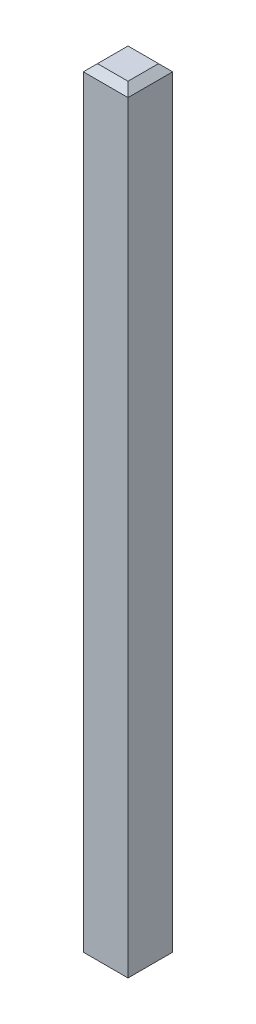
ISO-10303-21;
HEADER;
FILE_DESCRIPTION(('STEP AP214'),'2;1');
FILE_NAME('part.step','',(''),(''),'','','');
FILE_SCHEMA(('AUTOMOTIVE_DESIGN { 1 0 10303 214 1 1 1 1 }'));
ENDSEC;
DATA;
#1=APPLICATION_CONTEXT('core data for automotive mechanical design processes');
#2=APPLICATION_PROTOCOL_DEFINITION('international standard','automotive_design',2000,#1);
#3=PRODUCT_CONTEXT('',#1,'mechanical');
#4=PRODUCT('Part','Part','',(#3));
#5=PRODUCT_RELATED_PRODUCT_CATEGORY('part','',(#4));
#6=PRODUCT_DEFINITION_FORMATION('','',#4);
#7=PRODUCT_DEFINITION_CONTEXT('part definition',#1,'design');
#8=PRODUCT_DEFINITION('design','',#6,#7);
#9=PRODUCT_DEFINITION_SHAPE('','',#8);
#10=(LENGTH_UNIT() NAMED_UNIT(*) SI_UNIT(.MILLI.,.METRE.));
#11=(NAMED_UNIT(*) PLANE_ANGLE_UNIT() SI_UNIT($,.RADIAN.));
#12=(NAMED_UNIT(*) SI_UNIT($,.STERADIAN.) SOLID_ANGLE_UNIT());
#13=UNCERTAINTY_MEASURE_WITH_UNIT(LENGTH_MEASURE(1.E-05),#10,'distance_accuracy_value','');
#14=(GEOMETRIC_REPRESENTATION_CONTEXT(3) GLOBAL_UNCERTAINTY_ASSIGNED_CONTEXT((#13)) GLOBAL_UNIT_ASSIGNED_CONTEXT((#10,
#11,#12)) REPRESENTATION_CONTEXT('',''));
#15=CARTESIAN_POINT('',(0.,0.,0.));
#16=DIRECTION('',(0.,0.,1.));
#17=DIRECTION('',(1.,0.,0.));
#18=AXIS2_PLACEMENT_3D('',#15,#16,#17);
#19=CARTESIAN_POINT('',(0.,10.95,0.215));
#20=DIRECTION('',(0.,0.707106781186545,0.707106781186551));
#21=DIRECTION('',(1.,0.,0.));
#22=AXIS2_PLACEMENT_3D('',#19,#20,#21);
#23=PLANE('',#22);
#24=DIRECTION('',(-0.577350269189624,-0.577350269189629,0.577350269189624));
#25=VECTOR('',#24,1.);
#26=CARTESIAN_POINT('',(-0.143333333333333,11.0216666666667,0.143333333333334));
#27=LINE('',#26,#25);
#28=CARTESIAN_POINT('',(-0.215,10.95,0.215));
#29=VERTEX_POINT('',#28);
#30=CARTESIAN_POINT('',(-0.315,10.85,0.315));
#31=VERTEX_POINT('',#30);
#32=EDGE_CURVE('E27',#29,#31,#27,.T.);
#33=ORIENTED_EDGE('',*,*,#32,.T.);
#34=DIRECTION('',(-1.,0.,0.));
#35=VECTOR('',#34,1.);
#36=CARTESIAN_POINT('',(-0.315,10.85,0.315));
#37=LINE('',#36,#35);
#38=CARTESIAN_POINT('',(0.315,10.85,0.315));
#39=VERTEX_POINT('',#38);
#40=EDGE_CURVE('E135',#39,#31,#37,.T.);
#41=ORIENTED_EDGE('',*,*,#40,.F.);
#42=DIRECTION('',(-0.577350269189624,0.577350269189629,-0.577350269189624));
#43=VECTOR('',#42,1.);
#44=CARTESIAN_POINT('',(0.143333333333334,11.0216666666667,0.143333333333334));
#45=LINE('',#44,#43);
#46=CARTESIAN_POINT('',(0.215,10.95,0.215));
#47=VERTEX_POINT('',#46);
#48=EDGE_CURVE('E11',#39,#47,#45,.T.);
#49=ORIENTED_EDGE('',*,*,#48,.T.);
#50=DIRECTION('',(1.,0.,0.));
#51=VECTOR('',#50,1.);
#52=CARTESIAN_POINT('',(0.315,10.95,0.215));
#53=LINE('',#52,#51);
#54=EDGE_CURVE('E138',#29,#47,#53,.T.);
#55=ORIENTED_EDGE('',*,*,#54,.F.);
#56=EDGE_LOOP('',(#33,#41,#49,#55));
#57=FACE_BOUND('',#56,.T.);
#58=ADVANCED_FACE('F17',(#57),#23,.T.);
#59=CARTESIAN_POINT('',(0.215,10.95,0.));
#60=DIRECTION('',(0.707106781186551,0.707106781186545,0.));
#61=DIRECTION('',(0.,0.,-1.));
#62=AXIS2_PLACEMENT_3D('',#59,#60,#61);
#63=PLANE('',#62);
#64=DIRECTION('',(-0.577350269189624,0.577350269189629,0.577350269189624));
#65=VECTOR('',#64,1.);
#66=CARTESIAN_POINT('',(0.143333333333334,11.0216666666667,-0.143333333333334));
#67=LINE('',#66,#65);
#68=CARTESIAN_POINT('',(0.315,10.85,-0.315));
#69=VERTEX_POINT('',#68);
#70=CARTESIAN_POINT('',(0.215,10.95,-0.215));
#71=VERTEX_POINT('',#70);
#72=EDGE_CURVE('E86',#69,#71,#67,.T.);
#73=ORIENTED_EDGE('',*,*,#72,.T.);
#74=DIRECTION('',(0.,0.,-1.));
#75=VECTOR('',#74,1.);
#76=CARTESIAN_POINT('',(0.215,10.95,-0.315));
#77=LINE('',#76,#75);
#78=EDGE_CURVE('E109',#47,#71,#77,.T.);
#79=ORIENTED_EDGE('',*,*,#78,.F.);
#80=ORIENTED_EDGE('',*,*,#48,.F.);
#81=DIRECTION('',(0.,0.,1.));
#82=VECTOR('',#81,1.);
#83=CARTESIAN_POINT('',(0.315,10.85,0.315));
#84=LINE('',#83,#82);
#85=EDGE_CURVE('E236',#69,#39,#84,.T.);
#86=ORIENTED_EDGE('',*,*,#85,.F.);
#87=EDGE_LOOP('',(#73,#79,#80,#86));
#88=FACE_BOUND('',#87,.T.);
#89=ADVANCED_FACE('F190',(#88),#63,.T.);
#90=CARTESIAN_POINT('',(-0.215,10.95,0.));
#91=DIRECTION('',(-0.707106781186551,0.707106781186545,0.));
#92=DIRECTION('',(0.,0.,1.));
#93=AXIS2_PLACEMENT_3D('',#90,#91,#92);
#94=PLANE('',#93);
#95=DIRECTION('',(-0.577350269189624,-0.577350269189629,-0.577350269189624));
#96=VECTOR('',#95,1.);
#97=CARTESIAN_POINT('',(-0.143333333333333,11.0216666666667,-0.143333333333334));
#98=LINE('',#97,#96);
#99=CARTESIAN_POINT('',(-0.215,10.95,-0.215));
#100=VERTEX_POINT('',#99);
#101=CARTESIAN_POINT('',(-0.315,10.85,-0.315));
#102=VERTEX_POINT('',#101);
#103=EDGE_CURVE('E124',#100,#102,#98,.T.);
#104=ORIENTED_EDGE('',*,*,#103,.T.);
#105=DIRECTION('',(0.,0.,-1.));
#106=VECTOR('',#105,1.);
#107=CARTESIAN_POINT('',(-0.315,10.85,-0.315));
#108=LINE('',#107,#106);
#109=EDGE_CURVE('E157',#31,#102,#108,.T.);
#110=ORIENTED_EDGE('',*,*,#109,.F.);
#111=ORIENTED_EDGE('',*,*,#32,.F.);
#112=DIRECTION('',(0.,0.,1.));
#113=VECTOR('',#112,1.);
#114=CARTESIAN_POINT('',(-0.215,10.95,0.315));
#115=LINE('',#114,#113);
#116=EDGE_CURVE('E153',#100,#29,#115,.T.);
#117=ORIENTED_EDGE('',*,*,#116,.F.);
#118=EDGE_LOOP('',(#104,#110,#111,#117));
#119=FACE_BOUND('',#118,.T.);
#120=ADVANCED_FACE('F19',(#119),#94,.T.);
#121=CARTESIAN_POINT('',(0.,10.95,-0.215));
#122=DIRECTION('',(0.,0.707106781186545,-0.707106781186551));
#123=DIRECTION('',(-1.,0.,0.));
#124=AXIS2_PLACEMENT_3D('',#121,#122,#123);
#125=PLANE('',#124);
#126=ORIENTED_EDGE('',*,*,#72,.F.);
#127=DIRECTION('',(1.,0.,0.));
#128=VECTOR('',#127,1.);
#129=CARTESIAN_POINT('',(0.315,10.85,-0.315));
#130=LINE('',#129,#128);
#131=EDGE_CURVE('E170',#102,#69,#130,.T.);
#132=ORIENTED_EDGE('',*,*,#131,.F.);
#133=ORIENTED_EDGE('',*,*,#103,.F.);
#134=DIRECTION('',(-1.,0.,0.));
#135=VECTOR('',#134,1.);
#136=CARTESIAN_POINT('',(-0.315,10.95,-0.215));
#137=LINE('',#136,#135);
#138=EDGE_CURVE('E102',#71,#100,#137,.T.);
#139=ORIENTED_EDGE('',*,*,#138,.F.);
#140=EDGE_LOOP('',(#126,#132,#133,#139));
#141=FACE_BOUND('',#140,.T.);
#142=ADVANCED_FACE('F259',(#141),#125,.T.);
#143=CARTESIAN_POINT('',(-0.315,0.1,-0.315));
#144=DIRECTION('',(0.,0.707106781186542,0.707106781186554));
#145=DIRECTION('',(1.,0.,0.));
#146=AXIS2_PLACEMENT_3D('',#143,#144,#145);
#147=PLANE('',#146);
#148=DIRECTION('',(-0.577350269189622,-0.577350269189633,0.577350269189623));
#149=VECTOR('',#148,1.);
#150=CARTESIAN_POINT('',(0.315,0.1,-0.315));
#151=LINE('',#150,#149);
#152=CARTESIAN_POINT('',(0.315,0.1,-0.315));
#153=VERTEX_POINT('',#152);
#154=CARTESIAN_POINT('',(0.215,0.,-0.215));
#155=VERTEX_POINT('',#154);
#156=EDGE_CURVE('E87',#153,#155,#151,.T.);
#157=ORIENTED_EDGE('',*,*,#156,.T.);
#158=DIRECTION('',(1.,0.,0.));
#159=VECTOR('',#158,1.);
#160=CARTESIAN_POINT('',(0.,0.,-0.215));
#161=LINE('',#160,#159);
#162=CARTESIAN_POINT('',(-0.215,0.,-0.215));
#163=VERTEX_POINT('',#162);
#164=EDGE_CURVE('E90',#163,#155,#161,.T.);
#165=ORIENTED_EDGE('',*,*,#164,.F.);
#166=DIRECTION('',(-0.577350269189622,0.577350269189632,-0.577350269189622));
#167=VECTOR('',#166,1.);
#168=CARTESIAN_POINT('',(-0.315,0.1,-0.315));
#169=LINE('',#168,#167);
#170=CARTESIAN_POINT('',(-0.315,0.1,-0.315));
#171=VERTEX_POINT('',#170);
#172=EDGE_CURVE('E73',#163,#171,#169,.T.);
#173=ORIENTED_EDGE('',*,*,#172,.T.);
#174=DIRECTION('',(-1.,0.,0.));
#175=VECTOR('',#174,1.);
#176=CARTESIAN_POINT('',(-0.315,0.1,-0.315));
#177=LINE('',#176,#175);
#178=EDGE_CURVE('E243',#153,#171,#177,.T.);
#179=ORIENTED_EDGE('',*,*,#178,.F.);
#180=EDGE_LOOP('',(#157,#165,#173,#179));
#181=FACE_BOUND('',#180,.T.);
#182=ADVANCED_FACE('F91',(#181),#147,.F.);
#183=CARTESIAN_POINT('',(-0.315,0.1,-0.315));
#184=DIRECTION('',(0.707106781186554,0.707106781186542,0.));
#185=DIRECTION('',(0.,0.,-1.));
#186=AXIS2_PLACEMENT_3D('',#183,#184,#185);
#187=PLANE('',#186);
#188=DIRECTION('',(-0.577350269189622,0.577350269189633,0.577350269189623));
#189=VECTOR('',#188,1.);
#190=CARTESIAN_POINT('',(-0.315,0.1,0.315));
#191=LINE('',#190,#189);
#192=CARTESIAN_POINT('',(-0.215,0.,0.215));
#193=VERTEX_POINT('',#192);
#194=CARTESIAN_POINT('',(-0.315,0.1,0.315));
#195=VERTEX_POINT('',#194);
#196=EDGE_CURVE('E117',#193,#195,#191,.T.);
#197=ORIENTED_EDGE('',*,*,#196,.T.);
#198=DIRECTION('',(0.,0.,1.));
#199=VECTOR('',#198,1.);
#200=CARTESIAN_POINT('',(-0.315,0.1,-0.315));
#201=LINE('',#200,#199);
#202=EDGE_CURVE('E81',#171,#195,#201,.T.);
#203=ORIENTED_EDGE('',*,*,#202,.F.);
#204=ORIENTED_EDGE('',*,*,#172,.F.);
#205=DIRECTION('',(0.,0.,-1.));
#206=VECTOR('',#205,1.);
#207=CARTESIAN_POINT('',(-0.215,0.,0.));
#208=LINE('',#207,#206);
#209=EDGE_CURVE('E78',#193,#163,#208,.T.);
#210=ORIENTED_EDGE('',*,*,#209,.F.);
#211=EDGE_LOOP('',(#197,#203,#204,#210));
#212=FACE_BOUND('',#211,.T.);
#213=ADVANCED_FACE('F76',(#212),#187,.F.);
#214=CARTESIAN_POINT('',(0.315,0.1,-0.315));
#215=DIRECTION('',(-0.707106781186554,0.707106781186542,0.));
#216=DIRECTION('',(0.,0.,1.));
#217=AXIS2_PLACEMENT_3D('',#214,#215,#216);
#218=PLANE('',#217);
#219=DIRECTION('',(-0.577350269189622,-0.577350269189632,-0.577350269189622));
#220=VECTOR('',#219,1.);
#221=CARTESIAN_POINT('',(0.105000000000002,-0.11,0.105000000000002));
#222=LINE('',#221,#220);
#223=CARTESIAN_POINT('',(0.315,0.1,0.315));
#224=VERTEX_POINT('',#223);
#225=CARTESIAN_POINT('',(0.215,0.,0.215));
#226=VERTEX_POINT('',#225);
#227=EDGE_CURVE('E40',#224,#226,#222,.T.);
#228=ORIENTED_EDGE('',*,*,#227,.T.);
#229=DIRECTION('',(0.,0.,1.));
#230=VECTOR('',#229,1.);
#231=CARTESIAN_POINT('',(0.215,0.,0.));
#232=LINE('',#231,#230);
#233=EDGE_CURVE('E96',#155,#226,#232,.T.);
#234=ORIENTED_EDGE('',*,*,#233,.F.);
#235=ORIENTED_EDGE('',*,*,#156,.F.);
#236=DIRECTION('',(0.,0.,-1.));
#237=VECTOR('',#236,1.);
#238=CARTESIAN_POINT('',(0.315,0.1,-0.315));
#239=LINE('',#238,#237);
#240=EDGE_CURVE('E228',#224,#153,#239,.T.);
#241=ORIENTED_EDGE('',*,*,#240,.F.);
#242=EDGE_LOOP('',(#228,#234,#235,#241));
#243=FACE_BOUND('',#242,.T.);
#244=ADVANCED_FACE('F229',(#243),#218,.F.);
#245=CARTESIAN_POINT('',(-0.315,0.1,0.315));
#246=DIRECTION('',(0.,0.707106781186542,-0.707106781186554));
#247=DIRECTION('',(-1.,0.,0.));
#248=AXIS2_PLACEMENT_3D('',#245,#246,#247);
#249=PLANE('',#248);
#250=ORIENTED_EDGE('',*,*,#196,.F.);
#251=DIRECTION('',(-1.,0.,0.));
#252=VECTOR('',#251,1.);
#253=CARTESIAN_POINT('',(0.,0.,0.215));
#254=LINE('',#253,#252);
#255=EDGE_CURVE('E100',#226,#193,#254,.T.);
#256=ORIENTED_EDGE('',*,*,#255,.F.);
#257=ORIENTED_EDGE('',*,*,#227,.F.);
#258=DIRECTION('',(1.,0.,0.));
#259=VECTOR('',#258,1.);
#260=CARTESIAN_POINT('',(-0.315,0.1,0.315));
#261=LINE('',#260,#259);
#262=EDGE_CURVE('E154',#195,#224,#261,.T.);
#263=ORIENTED_EDGE('',*,*,#262,.F.);
#264=EDGE_LOOP('',(#250,#256,#257,#263));
#265=FACE_BOUND('',#264,.T.);
#266=ADVANCED_FACE('F226',(#265),#249,.F.);
#267=CARTESIAN_POINT('',(0.,0.,0.));
#268=DIRECTION('',(0.,1.,0.));
#269=DIRECTION('',(1.,0.,0.));
#270=AXIS2_PLACEMENT_3D('',#267,#268,#269);
#271=PLANE('',#270);
#272=ORIENTED_EDGE('',*,*,#209,.T.);
#273=ORIENTED_EDGE('',*,*,#164,.T.);
#274=ORIENTED_EDGE('',*,*,#233,.T.);
#275=ORIENTED_EDGE('',*,*,#255,.T.);
#276=EDGE_LOOP('',(#272,#273,#274,#275));
#277=FACE_BOUND('',#276,.T.);
#278=ADVANCED_FACE('F99',(#277),#271,.F.);
#279=CARTESIAN_POINT('',(0.,10.95,0.));
#280=DIRECTION('',(0.,1.,0.));
#281=DIRECTION('',(1.,0.,0.));
#282=AXIS2_PLACEMENT_3D('',#279,#280,#281);
#283=PLANE('',#282);
#284=ORIENTED_EDGE('',*,*,#116,.T.);
#285=ORIENTED_EDGE('',*,*,#54,.T.);
#286=ORIENTED_EDGE('',*,*,#78,.T.);
#287=ORIENTED_EDGE('',*,*,#138,.T.);
#288=EDGE_LOOP('',(#284,#285,#286,#287));
#289=FACE_BOUND('',#288,.T.);
#290=ADVANCED_FACE('F186',(#289),#283,.T.);
#291=CARTESIAN_POINT('',(-0.315,10.95,0.315));
#292=DIRECTION('',(0.,0.,-1.));
#293=DIRECTION('',(0.,-1.,0.));
#294=AXIS2_PLACEMENT_3D('',#291,#292,#293);
#295=PLANE('',#294);
#296=DIRECTION('',(0.,-1.,0.));
#297=VECTOR('',#296,1.);
#298=CARTESIAN_POINT('',(-0.315,10.95,0.315));
#299=LINE('',#298,#297);
#300=EDGE_CURVE('E149',#31,#195,#299,.T.);
#301=ORIENTED_EDGE('',*,*,#300,.T.);
#302=ORIENTED_EDGE('',*,*,#262,.T.);
#303=DIRECTION('',(0.,-1.,0.));
#304=VECTOR('',#303,1.);
#305=CARTESIAN_POINT('',(0.315,10.95,0.315));
#306=LINE('',#305,#304);
#307=EDGE_CURVE('E151',#39,#224,#306,.T.);
#308=ORIENTED_EDGE('',*,*,#307,.F.);
#309=ORIENTED_EDGE('',*,*,#40,.T.);
#310=EDGE_LOOP('',(#301,#302,#308,#309));
#311=FACE_BOUND('',#310,.T.);
#312=ADVANCED_FACE('F146',(#311),#295,.F.);
#313=CARTESIAN_POINT('',(-0.315,10.95,-0.315));
#314=DIRECTION('',(1.,0.,0.));
#315=DIRECTION('',(0.,0.,-1.));
#316=AXIS2_PLACEMENT_3D('',#313,#314,#315);
#317=PLANE('',#316);
#318=DIRECTION('',(0.,-1.,0.));
#319=VECTOR('',#318,1.);
#320=CARTESIAN_POINT('',(-0.315,10.95,-0.315));
#321=LINE('',#320,#319);
#322=EDGE_CURVE('E247',#102,#171,#321,.T.);
#323=ORIENTED_EDGE('',*,*,#322,.T.);
#324=ORIENTED_EDGE('',*,*,#202,.T.);
#325=ORIENTED_EDGE('',*,*,#300,.F.);
#326=ORIENTED_EDGE('',*,*,#109,.T.);
#327=EDGE_LOOP('',(#323,#324,#325,#326));
#328=FACE_BOUND('',#327,.T.);
#329=ADVANCED_FACE('F164',(#328),#317,.F.);
#330=CARTESIAN_POINT('',(-0.315,10.95,-0.315));
#331=DIRECTION('',(0.,0.,1.));
#332=DIRECTION('',(1.,0.,0.));
#333=AXIS2_PLACEMENT_3D('',#330,#331,#332);
#334=PLANE('',#333);
#335=DIRECTION('',(0.,-1.,0.));
#336=VECTOR('',#335,1.);
#337=CARTESIAN_POINT('',(0.315,10.95,-0.315));
#338=LINE('',#337,#336);
#339=EDGE_CURVE('E233',#69,#153,#338,.T.);
#340=ORIENTED_EDGE('',*,*,#339,.T.);
#341=ORIENTED_EDGE('',*,*,#178,.T.);
#342=ORIENTED_EDGE('',*,*,#322,.F.);
#343=ORIENTED_EDGE('',*,*,#131,.T.);
#344=EDGE_LOOP('',(#340,#341,#342,#343));
#345=FACE_BOUND('',#344,.T.);
#346=ADVANCED_FACE('F258',(#345),#334,.F.);
#347=CARTESIAN_POINT('',(0.315,10.95,-0.315));
#348=DIRECTION('',(-1.,0.,0.));
#349=DIRECTION('',(0.,1.,0.));
#350=AXIS2_PLACEMENT_3D('',#347,#348,#349);
#351=PLANE('',#350);
#352=ORIENTED_EDGE('',*,*,#307,.T.);
#353=ORIENTED_EDGE('',*,*,#240,.T.);
#354=ORIENTED_EDGE('',*,*,#339,.F.);
#355=ORIENTED_EDGE('',*,*,#85,.T.);
#356=EDGE_LOOP('',(#352,#353,#354,#355));
#357=FACE_BOUND('',#356,.T.);
#358=ADVANCED_FACE('F235',(#357),#351,.F.);
#359=CLOSED_SHELL('',(#58,#89,#120,#142,#182,#213,#244,#266,#278,#290,#312,#329,#346,#358));
#360=MANIFOLD_SOLID_BREP('B1',#359);
#361=ADVANCED_BREP_SHAPE_REPRESENTATION('',(#18,#360),#14);
#362=SHAPE_DEFINITION_REPRESENTATION(#9,#361);
ENDSEC;
END-ISO-10303-21;
